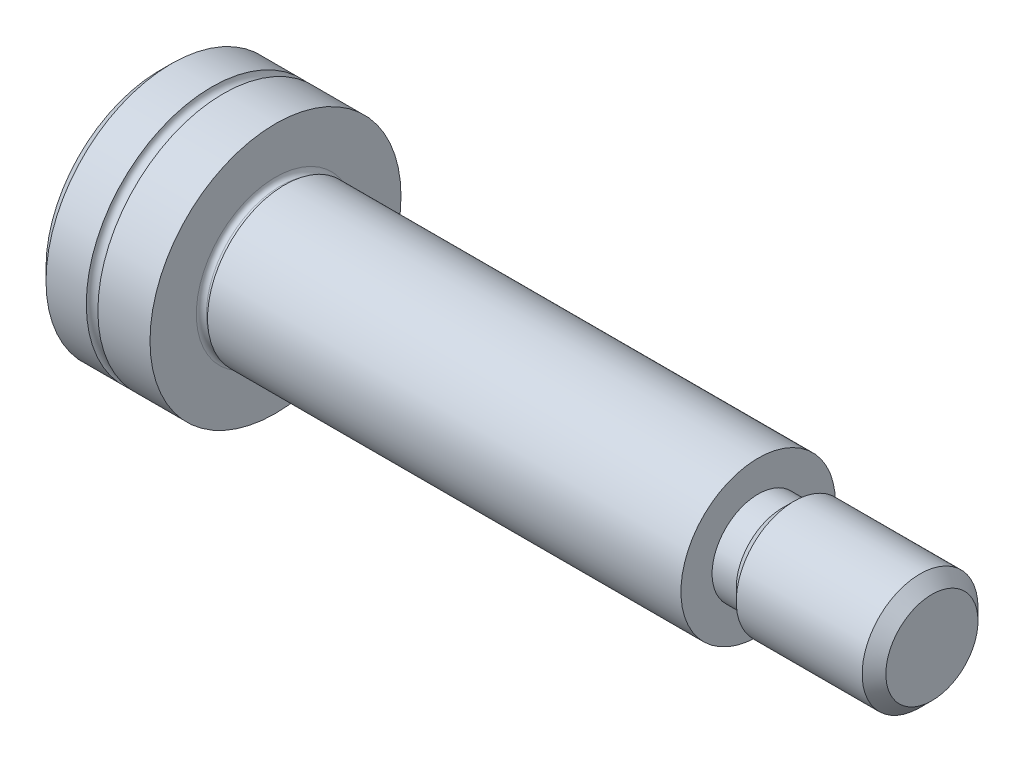
ISO-10303-21;
HEADER;
FILE_DESCRIPTION(('STEP AP214'),'2;1');
FILE_NAME('part.step','',(''),(''),'','','');
FILE_SCHEMA(('AUTOMOTIVE_DESIGN { 1 0 10303 214 1 1 1 1 }'));
ENDSEC;
DATA;
#1=APPLICATION_CONTEXT('core data for automotive mechanical design processes');
#2=APPLICATION_PROTOCOL_DEFINITION('international standard','automotive_design',2000,#1);
#3=PRODUCT_CONTEXT('',#1,'mechanical');
#4=PRODUCT('Part','Part','',(#3));
#5=PRODUCT_RELATED_PRODUCT_CATEGORY('part','',(#4));
#6=PRODUCT_DEFINITION_FORMATION('','',#4);
#7=PRODUCT_DEFINITION_CONTEXT('part definition',#1,'design');
#8=PRODUCT_DEFINITION('design','',#6,#7);
#9=PRODUCT_DEFINITION_SHAPE('','',#8);
#10=(LENGTH_UNIT() NAMED_UNIT(*) SI_UNIT(.MILLI.,.METRE.));
#11=(NAMED_UNIT(*) PLANE_ANGLE_UNIT() SI_UNIT($,.RADIAN.));
#12=(NAMED_UNIT(*) SI_UNIT($,.STERADIAN.) SOLID_ANGLE_UNIT());
#13=UNCERTAINTY_MEASURE_WITH_UNIT(LENGTH_MEASURE(1.E-05),#10,'distance_accuracy_value','');
#14=(GEOMETRIC_REPRESENTATION_CONTEXT(3) GLOBAL_UNCERTAINTY_ASSIGNED_CONTEXT((#13)) GLOBAL_UNIT_ASSIGNED_CONTEXT((#10,
#11,#12)) REPRESENTATION_CONTEXT('',''));
#15=CARTESIAN_POINT('',(0.,0.,0.));
#16=DIRECTION('',(0.,0.,1.));
#17=DIRECTION('',(1.,0.,0.));
#18=AXIS2_PLACEMENT_3D('',#15,#16,#17);
#19=CARTESIAN_POINT('',(0.,0.,0.));
#20=DIRECTION('',(-1.,0.,0.));
#21=DIRECTION('',(0.,0.,1.));
#22=AXIS2_PLACEMENT_3D('',#19,#20,#21);
#23=CYLINDRICAL_SURFACE('',#22,6.5);
#24=CARTESIAN_POINT('',(0.,0.,0.));
#25=DIRECTION('',(-1.,0.,0.));
#26=DIRECTION('',(0.,0.,1.));
#27=AXIS2_PLACEMENT_3D('',#24,#25,#26);
#28=CIRCLE('',#27,6.5);
#29=CARTESIAN_POINT('',(0.,0.,6.5));
#30=VERTEX_POINT('',#29);
#31=EDGE_CURVE('E160',#30,#30,#28,.T.);
#32=ORIENTED_EDGE('',*,*,#31,.T.);
#33=EDGE_LOOP('',(#32));
#34=FACE_BOUND('',#33,.T.);
#35=CARTESIAN_POINT('',(-2.7,0.,0.));
#36=DIRECTION('',(-1.,0.,0.));
#37=DIRECTION('',(0.,0.,1.));
#38=AXIS2_PLACEMENT_3D('',#35,#36,#37);
#39=CIRCLE('',#38,6.5);
#40=CARTESIAN_POINT('',(-2.7,0.,6.5));
#41=VERTEX_POINT('',#40);
#42=EDGE_CURVE('E166',#41,#41,#39,.T.);
#43=ORIENTED_EDGE('',*,*,#42,.F.);
#44=EDGE_LOOP('',(#43));
#45=FACE_BOUND('',#44,.T.);
#46=ADVANCED_FACE('F32',(#34,#45),#23,.T.);
#47=CARTESIAN_POINT('',(-3.,0.,0.));
#48=DIRECTION('',(-1.,0.,0.));
#49=DIRECTION('',(0.,0.,1.));
#50=AXIS2_PLACEMENT_3D('',#47,#48,#49);
#51=TOROIDAL_SURFACE('',#50,6.5,0.299999999999998);
#52=ORIENTED_EDGE('',*,*,#42,.T.);
#53=EDGE_LOOP('',(#52));
#54=FACE_BOUND('',#53,.T.);
#55=CARTESIAN_POINT('',(-3.3,0.,0.));
#56=DIRECTION('',(-1.,0.,0.));
#57=DIRECTION('',(0.,0.,1.));
#58=AXIS2_PLACEMENT_3D('',#55,#56,#57);
#59=CIRCLE('',#58,6.5);
#60=CARTESIAN_POINT('',(-3.3,0.,6.5));
#61=VERTEX_POINT('',#60);
#62=EDGE_CURVE('E163',#61,#61,#59,.T.);
#63=ORIENTED_EDGE('',*,*,#62,.F.);
#64=EDGE_LOOP('',(#63));
#65=FACE_BOUND('',#64,.T.);
#66=ADVANCED_FACE('F196',(#54,#65),#51,.F.);
#67=CARTESIAN_POINT('',(0.,0.,0.));
#68=DIRECTION('',(-1.,0.,0.));
#69=DIRECTION('',(0.,0.,1.));
#70=AXIS2_PLACEMENT_3D('',#67,#68,#69);
#71=CYLINDRICAL_SURFACE('',#70,6.5);
#72=CARTESIAN_POINT('',(-5.38650000003255,0.,0.));
#73=DIRECTION('',(-1.,0.,0.));
#74=DIRECTION('',(0.,0.,1.));
#75=AXIS2_PLACEMENT_3D('',#72,#73,#74);
#76=CIRCLE('',#75,6.5);
#77=CARTESIAN_POINT('',(-5.38650000003255,0.,6.5));
#78=VERTEX_POINT('',#77);
#79=EDGE_CURVE('E172',#78,#78,#76,.F.);
#80=ORIENTED_EDGE('',*,*,#79,.T.);
#81=EDGE_LOOP('',(#80));
#82=FACE_BOUND('',#81,.T.);
#83=ORIENTED_EDGE('',*,*,#62,.T.);
#84=EDGE_LOOP('',(#83));
#85=FACE_BOUND('',#84,.T.);
#86=ADVANCED_FACE('F202',(#82,#85),#71,.T.);
#87=CARTESIAN_POINT('',(-6.,0.,0.));
#88=DIRECTION('',(-1.,0.,0.));
#89=DIRECTION('',(0.,0.,1.));
#90=AXIS2_PLACEMENT_3D('',#87,#88,#89);
#91=PLANE('',#90);
#92=CARTESIAN_POINT('',(-6.,0.,0.));
#93=DIRECTION('',(-1.,0.,0.));
#94=DIRECTION('',(0.,0.,1.));
#95=AXIS2_PLACEMENT_3D('',#92,#93,#94);
#96=CIRCLE('',#95,5.88649999997571);
#97=CARTESIAN_POINT('',(-6.,0.,5.88649999997571));
#98=VERTEX_POINT('',#97);
#99=EDGE_CURVE('E169',#98,#98,#96,.T.);
#100=ORIENTED_EDGE('',*,*,#99,.T.);
#101=EDGE_LOOP('',(#100));
#102=FACE_BOUND('',#101,.T.);
#103=DIRECTION('',(0.,0.500000000000001,0.866025403784438));
#104=VECTOR('',#103,1.);
#105=CARTESIAN_POINT('',(-6.,-2.88675134594813,0.));
#106=LINE('',#105,#104);
#107=CARTESIAN_POINT('',(-6.,-2.88675134594813,0.));
#108=VERTEX_POINT('',#107);
#109=CARTESIAN_POINT('',(-6.,-1.44337567297406,2.5));
#110=VERTEX_POINT('',#109);
#111=EDGE_CURVE('E47',#108,#110,#106,.T.);
#112=ORIENTED_EDGE('',*,*,#111,.F.);
#113=DIRECTION('',(0.,-0.500000000000001,0.866025403784438));
#114=VECTOR('',#113,1.);
#115=CARTESIAN_POINT('',(-6.,-1.44337567297406,-2.5));
#116=LINE('',#115,#114);
#117=CARTESIAN_POINT('',(-6.,-1.44337567297406,-2.5));
#118=VERTEX_POINT('',#117);
#119=EDGE_CURVE('E133',#118,#108,#116,.T.);
#120=ORIENTED_EDGE('',*,*,#119,.F.);
#121=DIRECTION('',(0.,-1.,0.));
#122=VECTOR('',#121,1.);
#123=CARTESIAN_POINT('',(-6.,1.44337567297406,-2.5));
#124=LINE('',#123,#122);
#125=CARTESIAN_POINT('',(-6.,1.44337567297406,-2.5));
#126=VERTEX_POINT('',#125);
#127=EDGE_CURVE('E131',#126,#118,#124,.T.);
#128=ORIENTED_EDGE('',*,*,#127,.F.);
#129=DIRECTION('',(0.,-0.500000000000001,-0.866025403784438));
#130=VECTOR('',#129,1.);
#131=CARTESIAN_POINT('',(-6.,2.88675134594813,0.));
#132=LINE('',#131,#130);
#133=CARTESIAN_POINT('',(-6.,2.88675134594813,0.));
#134=VERTEX_POINT('',#133);
#135=EDGE_CURVE('E97',#134,#126,#132,.T.);
#136=ORIENTED_EDGE('',*,*,#135,.F.);
#137=DIRECTION('',(0.,0.5,-0.866025403784438));
#138=VECTOR('',#137,1.);
#139=CARTESIAN_POINT('',(-6.,1.44337567297406,2.5));
#140=LINE('',#139,#138);
#141=CARTESIAN_POINT('',(-6.,1.44337567297406,2.5));
#142=VERTEX_POINT('',#141);
#143=EDGE_CURVE('E127',#142,#134,#140,.T.);
#144=ORIENTED_EDGE('',*,*,#143,.F.);
#145=DIRECTION('',(0.,1.,0.));
#146=VECTOR('',#145,1.);
#147=CARTESIAN_POINT('',(-6.,-1.44337567297406,2.5));
#148=LINE('',#147,#146);
#149=EDGE_CURVE('E123',#110,#142,#148,.T.);
#150=ORIENTED_EDGE('',*,*,#149,.F.);
#151=EDGE_LOOP('',(#112,#120,#128,#136,#144,#150));
#152=FACE_BOUND('',#151,.T.);
#153=ADVANCED_FACE('F220',(#102,#152),#91,.T.);
#154=CARTESIAN_POINT('',(0.,6.5,0.));
#155=DIRECTION('',(1.,0.,0.));
#156=DIRECTION('',(0.,0.,-1.));
#157=AXIS2_PLACEMENT_3D('',#154,#155,#156);
#158=PLANE('',#157);
#159=CARTESIAN_POINT('',(0.,0.,0.));
#160=DIRECTION('',(1.,0.,0.));
#161=DIRECTION('',(0.,0.,-1.));
#162=AXIS2_PLACEMENT_3D('',#159,#160,#161);
#163=CIRCLE('',#162,4.101);
#164=CARTESIAN_POINT('',(0.,0.,-4.101));
#165=VERTEX_POINT('',#164);
#166=EDGE_CURVE('E11',#165,#165,#163,.F.);
#167=ORIENTED_EDGE('',*,*,#166,.T.);
#168=EDGE_LOOP('',(#167));
#169=FACE_BOUND('',#168,.T.);
#170=ORIENTED_EDGE('',*,*,#31,.F.);
#171=EDGE_LOOP('',(#170));
#172=FACE_BOUND('',#171,.T.);
#173=ADVANCED_FACE('F223',(#169,#172),#158,.T.);
#174=CARTESIAN_POINT('',(0.387623956953576,0.,0.));
#175=DIRECTION('',(-1.,0.,0.));
#176=DIRECTION('',(0.,0.,1.));
#177=AXIS2_PLACEMENT_3D('',#174,#175,#176);
#178=CYLINDRICAL_SURFACE('',#177,3.84);
#179=CARTESIAN_POINT('',(0.261000000000001,0.,0.));
#180=DIRECTION('',(1.,0.,0.));
#181=DIRECTION('',(0.,0.,-1.));
#182=AXIS2_PLACEMENT_3D('',#179,#180,#181);
#183=CIRCLE('',#182,3.84);
#184=CARTESIAN_POINT('',(0.261000000000001,0.,-3.84));
#185=VERTEX_POINT('',#184);
#186=EDGE_CURVE('E40',#185,#185,#183,.T.);
#187=ORIENTED_EDGE('',*,*,#186,.T.);
#188=EDGE_LOOP('',(#187));
#189=FACE_BOUND('',#188,.T.);
#190=CARTESIAN_POINT('',(0.387623956953576,0.,0.));
#191=DIRECTION('',(1.,0.,0.));
#192=DIRECTION('',(0.,0.,-1.));
#193=AXIS2_PLACEMENT_3D('',#190,#191,#192);
#194=CIRCLE('',#193,3.84);
#195=CARTESIAN_POINT('',(0.387623956953576,0.,-3.84));
#196=VERTEX_POINT('',#195);
#197=EDGE_CURVE('E157',#196,#196,#194,.T.);
#198=ORIENTED_EDGE('',*,*,#197,.F.);
#199=EDGE_LOOP('',(#198));
#200=FACE_BOUND('',#199,.T.);
#201=ADVANCED_FACE('F183',(#189,#200),#178,.T.);
#202=CARTESIAN_POINT('',(0.387623956953576,0.,0.));
#203=DIRECTION('',(1.,0.,0.));
#204=DIRECTION('',(0.,0.,-1.));
#205=AXIS2_PLACEMENT_3D('',#202,#203,#204);
#206=CONICAL_SURFACE('',#205,3.83999999996831,1.04719755126488);
#207=CARTESIAN_POINT('',(0.480000000000001,0.,0.));
#208=DIRECTION('',(1.,0.,0.));
#209=DIRECTION('',(0.,0.,-1.));
#210=AXIS2_PLACEMENT_3D('',#207,#208,#209);
#211=CIRCLE('',#210,3.99999999995212);
#212=CARTESIAN_POINT('',(0.480000000000001,0.,-3.99999999995212));
#213=VERTEX_POINT('',#212);
#214=EDGE_CURVE('E154',#213,#213,#211,.T.);
#215=ORIENTED_EDGE('',*,*,#214,.F.);
#216=EDGE_LOOP('',(#215));
#217=FACE_BOUND('',#216,.T.);
#218=ORIENTED_EDGE('',*,*,#197,.T.);
#219=EDGE_LOOP('',(#218));
#220=FACE_BOUND('',#219,.T.);
#221=ADVANCED_FACE('F281',(#217,#220),#206,.T.);
#222=CARTESIAN_POINT('',(25.,0.,0.));
#223=DIRECTION('',(-1.,0.,0.));
#224=DIRECTION('',(0.,0.,1.));
#225=AXIS2_PLACEMENT_3D('',#222,#223,#224);
#226=CYLINDRICAL_SURFACE('',#225,4.);
#227=CARTESIAN_POINT('',(25.,0.,0.));
#228=DIRECTION('',(1.,0.,0.));
#229=DIRECTION('',(0.,0.,-1.));
#230=AXIS2_PLACEMENT_3D('',#227,#228,#229);
#231=CIRCLE('',#230,4.);
#232=CARTESIAN_POINT('',(25.,0.,-4.));
#233=VERTEX_POINT('',#232);
#234=EDGE_CURVE('E149',#233,#233,#231,.T.);
#235=ORIENTED_EDGE('',*,*,#234,.F.);
#236=EDGE_LOOP('',(#235));
#237=FACE_BOUND('',#236,.T.);
#238=ORIENTED_EDGE('',*,*,#214,.T.);
#239=EDGE_LOOP('',(#238));
#240=FACE_BOUND('',#239,.T.);
#241=ADVANCED_FACE('F277',(#237,#240),#226,.T.);
#242=CARTESIAN_POINT('',(25.,0.,0.));
#243=DIRECTION('',(1.,0.,0.));
#244=DIRECTION('',(0.,0.,-1.));
#245=AXIS2_PLACEMENT_3D('',#242,#243,#244);
#246=PLANE('',#245);
#247=CARTESIAN_POINT('',(25.,0.,0.));
#248=DIRECTION('',(1.,0.,0.));
#249=DIRECTION('',(0.,0.,-1.));
#250=AXIS2_PLACEMENT_3D('',#247,#248,#249);
#251=CIRCLE('',#250,2.3865);
#252=CARTESIAN_POINT('',(25.,0.,-2.3865));
#253=VERTEX_POINT('',#252);
#254=EDGE_CURVE('E145',#253,#253,#251,.T.);
#255=ORIENTED_EDGE('',*,*,#254,.F.);
#256=EDGE_LOOP('',(#255));
#257=FACE_BOUND('',#256,.T.);
#258=ORIENTED_EDGE('',*,*,#234,.T.);
#259=EDGE_LOOP('',(#258));
#260=FACE_BOUND('',#259,.T.);
#261=ADVANCED_FACE('F273',(#257,#260),#246,.T.);
#262=CARTESIAN_POINT('',(26.25,0.,0.));
#263=DIRECTION('',(-1.,0.,0.));
#264=DIRECTION('',(0.,0.,1.));
#265=AXIS2_PLACEMENT_3D('',#262,#263,#264);
#266=CYLINDRICAL_SURFACE('',#265,2.3865);
#267=CARTESIAN_POINT('',(26.25,0.,0.));
#268=DIRECTION('',(1.,0.,0.));
#269=DIRECTION('',(0.,0.,-1.));
#270=AXIS2_PLACEMENT_3D('',#267,#268,#269);
#271=CIRCLE('',#270,2.3865);
#272=CARTESIAN_POINT('',(26.25,0.,-2.3865));
#273=VERTEX_POINT('',#272);
#274=EDGE_CURVE('E146',#273,#273,#271,.T.);
#275=ORIENTED_EDGE('',*,*,#274,.F.);
#276=EDGE_LOOP('',(#275));
#277=FACE_BOUND('',#276,.T.);
#278=ORIENTED_EDGE('',*,*,#254,.T.);
#279=EDGE_LOOP('',(#278));
#280=FACE_BOUND('',#279,.T.);
#281=ADVANCED_FACE('F269',(#277,#280),#266,.T.);
#282=CARTESIAN_POINT('',(26.25,0.,0.));
#283=DIRECTION('',(1.,0.,0.));
#284=DIRECTION('',(0.,0.,-1.));
#285=AXIS2_PLACEMENT_3D('',#282,#283,#284);
#286=CONICAL_SURFACE('',#285,2.38650000005236,0.785398163397452);
#287=CARTESIAN_POINT('',(26.8634999999335,0.,0.));
#288=DIRECTION('',(1.,0.,0.));
#289=DIRECTION('',(0.,0.,-1.));
#290=AXIS2_PLACEMENT_3D('',#287,#288,#289);
#291=CIRCLE('',#290,2.99999999998591);
#292=CARTESIAN_POINT('',(26.8634999999335,0.,-2.99999999998591));
#293=VERTEX_POINT('',#292);
#294=EDGE_CURVE('E137',#293,#293,#291,.T.);
#295=ORIENTED_EDGE('',*,*,#294,.F.);
#296=EDGE_LOOP('',(#295));
#297=FACE_BOUND('',#296,.T.);
#298=ORIENTED_EDGE('',*,*,#274,.T.);
#299=EDGE_LOOP('',(#298));
#300=FACE_BOUND('',#299,.T.);
#301=ADVANCED_FACE('F265',(#297,#300),#286,.T.);
#302=CARTESIAN_POINT('',(34.,0.,0.));
#303=DIRECTION('',(-1.,0.,0.));
#304=DIRECTION('',(0.,0.,1.));
#305=AXIS2_PLACEMENT_3D('',#302,#303,#304);
#306=CYLINDRICAL_SURFACE('',#305,3.);
#307=CARTESIAN_POINT('',(33.3865000000326,0.,0.));
#308=DIRECTION('',(1.,0.,0.));
#309=DIRECTION('',(0.,0.,-1.));
#310=AXIS2_PLACEMENT_3D('',#307,#308,#309);
#311=CIRCLE('',#310,3.);
#312=CARTESIAN_POINT('',(33.3865000000326,0.,-3.));
#313=VERTEX_POINT('',#312);
#314=EDGE_CURVE('E178',#313,#313,#311,.F.);
#315=ORIENTED_EDGE('',*,*,#314,.T.);
#316=EDGE_LOOP('',(#315));
#317=FACE_BOUND('',#316,.T.);
#318=ORIENTED_EDGE('',*,*,#294,.T.);
#319=EDGE_LOOP('',(#318));
#320=FACE_BOUND('',#319,.T.);
#321=ADVANCED_FACE('F261',(#317,#320),#306,.T.);
#322=CARTESIAN_POINT('',(34.,0.,0.));
#323=DIRECTION('',(1.,0.,0.));
#324=DIRECTION('',(0.,0.,-1.));
#325=AXIS2_PLACEMENT_3D('',#322,#323,#324);
#326=PLANE('',#325);
#327=CARTESIAN_POINT('',(34.,0.,0.));
#328=DIRECTION('',(1.,0.,0.));
#329=DIRECTION('',(0.,0.,-1.));
#330=AXIS2_PLACEMENT_3D('',#327,#328,#329);
#331=CIRCLE('',#330,2.38649999997573);
#332=CARTESIAN_POINT('',(34.,0.,-2.38649999997573));
#333=VERTEX_POINT('',#332);
#334=EDGE_CURVE('E175',#333,#333,#331,.T.);
#335=ORIENTED_EDGE('',*,*,#334,.T.);
#336=EDGE_LOOP('',(#335));
#337=FACE_BOUND('',#336,.T.);
#338=ADVANCED_FACE('F258',(#337),#326,.T.);
#339=CARTESIAN_POINT('',(-3.,-2.88675134594813,0.));
#340=DIRECTION('',(0.,-0.866025403784438,0.500000000000001));
#341=DIRECTION('',(0.,-0.500000000000001,-0.866025403784438));
#342=AXIS2_PLACEMENT_3D('',#339,#340,#341);
#343=PLANE('',#342);
#344=ORIENTED_EDGE('',*,*,#111,.T.);
#345=DIRECTION('',(-1.,0.,0.));
#346=VECTOR('',#345,1.);
#347=CARTESIAN_POINT('',(-3.,-1.44337567297406,2.5));
#348=LINE('',#347,#346);
#349=CARTESIAN_POINT('',(-3.,-1.44337567297406,2.5));
#350=VERTEX_POINT('',#349);
#351=EDGE_CURVE('E78',#350,#110,#348,.T.);
#352=ORIENTED_EDGE('',*,*,#351,.F.);
#353=DIRECTION('',(0.,0.500000000000001,0.866025403784438));
#354=VECTOR('',#353,1.);
#355=CARTESIAN_POINT('',(-3.,-2.88675134594813,0.));
#356=LINE('',#355,#354);
#357=CARTESIAN_POINT('',(-3.,-2.88675134594813,0.));
#358=VERTEX_POINT('',#357);
#359=EDGE_CURVE('E135',#358,#350,#356,.T.);
#360=ORIENTED_EDGE('',*,*,#359,.F.);
#361=DIRECTION('',(-1.,0.,0.));
#362=VECTOR('',#361,1.);
#363=CARTESIAN_POINT('',(-3.,-2.88675134594813,0.));
#364=LINE('',#363,#362);
#365=EDGE_CURVE('E55',#358,#108,#364,.T.);
#366=ORIENTED_EDGE('',*,*,#365,.T.);
#367=EDGE_LOOP('',(#344,#352,#360,#366));
#368=FACE_BOUND('',#367,.T.);
#369=ADVANCED_FACE('F248',(#368),#343,.F.);
#370=CARTESIAN_POINT('',(-3.,-1.44337567297406,-2.5));
#371=DIRECTION('',(0.,-0.866025403784438,-0.500000000000001));
#372=DIRECTION('',(0.,0.500000000000001,-0.866025403784438));
#373=AXIS2_PLACEMENT_3D('',#370,#371,#372);
#374=PLANE('',#373);
#375=ORIENTED_EDGE('',*,*,#119,.T.);
#376=ORIENTED_EDGE('',*,*,#365,.F.);
#377=DIRECTION('',(0.,-0.500000000000001,0.866025403784438));
#378=VECTOR('',#377,1.);
#379=CARTESIAN_POINT('',(-3.,-1.44337567297406,-2.5));
#380=LINE('',#379,#378);
#381=CARTESIAN_POINT('',(-3.,-1.44337567297406,-2.5));
#382=VERTEX_POINT('',#381);
#383=EDGE_CURVE('E109',#382,#358,#380,.T.);
#384=ORIENTED_EDGE('',*,*,#383,.F.);
#385=DIRECTION('',(-1.,0.,0.));
#386=VECTOR('',#385,1.);
#387=CARTESIAN_POINT('',(-3.,-1.44337567297406,-2.5));
#388=LINE('',#387,#386);
#389=EDGE_CURVE('E101',#382,#118,#388,.T.);
#390=ORIENTED_EDGE('',*,*,#389,.T.);
#391=EDGE_LOOP('',(#375,#376,#384,#390));
#392=FACE_BOUND('',#391,.T.);
#393=ADVANCED_FACE('F245',(#392),#374,.F.);
#394=CARTESIAN_POINT('',(-3.,1.44337567297406,-2.5));
#395=DIRECTION('',(0.,0.,-1.));
#396=DIRECTION('',(0.,1.,0.));
#397=AXIS2_PLACEMENT_3D('',#394,#395,#396);
#398=PLANE('',#397);
#399=ORIENTED_EDGE('',*,*,#127,.T.);
#400=ORIENTED_EDGE('',*,*,#389,.F.);
#401=DIRECTION('',(0.,-1.,0.));
#402=VECTOR('',#401,1.);
#403=CARTESIAN_POINT('',(-3.,1.44337567297406,-2.5));
#404=LINE('',#403,#402);
#405=CARTESIAN_POINT('',(-3.,1.44337567297406,-2.5));
#406=VERTEX_POINT('',#405);
#407=EDGE_CURVE('E105',#406,#382,#404,.T.);
#408=ORIENTED_EDGE('',*,*,#407,.F.);
#409=DIRECTION('',(-1.,0.,0.));
#410=VECTOR('',#409,1.);
#411=CARTESIAN_POINT('',(-3.,1.44337567297406,-2.5));
#412=LINE('',#411,#410);
#413=EDGE_CURVE('E90',#406,#126,#412,.T.);
#414=ORIENTED_EDGE('',*,*,#413,.T.);
#415=EDGE_LOOP('',(#399,#400,#408,#414));
#416=FACE_BOUND('',#415,.T.);
#417=ADVANCED_FACE('F106',(#416),#398,.F.);
#418=CARTESIAN_POINT('',(-3.,2.88675134594813,0.));
#419=DIRECTION('',(0.,0.866025403784438,-0.500000000000001));
#420=DIRECTION('',(0.,0.500000000000001,0.866025403784438));
#421=AXIS2_PLACEMENT_3D('',#418,#419,#420);
#422=PLANE('',#421);
#423=ORIENTED_EDGE('',*,*,#135,.T.);
#424=ORIENTED_EDGE('',*,*,#413,.F.);
#425=DIRECTION('',(0.,-0.500000000000001,-0.866025403784438));
#426=VECTOR('',#425,1.);
#427=CARTESIAN_POINT('',(-3.,2.88675134594813,0.));
#428=LINE('',#427,#426);
#429=CARTESIAN_POINT('',(-3.,2.88675134594813,0.));
#430=VERTEX_POINT('',#429);
#431=EDGE_CURVE('E94',#430,#406,#428,.T.);
#432=ORIENTED_EDGE('',*,*,#431,.F.);
#433=DIRECTION('',(-1.,0.,0.));
#434=VECTOR('',#433,1.);
#435=CARTESIAN_POINT('',(-3.,2.88675134594813,0.));
#436=LINE('',#435,#434);
#437=EDGE_CURVE('E102',#430,#134,#436,.T.);
#438=ORIENTED_EDGE('',*,*,#437,.T.);
#439=EDGE_LOOP('',(#423,#424,#432,#438));
#440=FACE_BOUND('',#439,.T.);
#441=ADVANCED_FACE('F92',(#440),#422,.F.);
#442=CARTESIAN_POINT('',(-3.,1.44337567297406,2.5));
#443=DIRECTION('',(0.,0.866025403784438,0.500000000000001));
#444=DIRECTION('',(0.,-0.500000000000001,0.866025403784438));
#445=AXIS2_PLACEMENT_3D('',#442,#443,#444);
#446=PLANE('',#445);
#447=ORIENTED_EDGE('',*,*,#143,.T.);
#448=ORIENTED_EDGE('',*,*,#437,.F.);
#449=DIRECTION('',(0.,0.5,-0.866025403784438));
#450=VECTOR('',#449,1.);
#451=CARTESIAN_POINT('',(-3.,1.44337567297406,2.5));
#452=LINE('',#451,#450);
#453=CARTESIAN_POINT('',(-3.,1.44337567297406,2.5));
#454=VERTEX_POINT('',#453);
#455=EDGE_CURVE('E115',#454,#430,#452,.T.);
#456=ORIENTED_EDGE('',*,*,#455,.F.);
#457=DIRECTION('',(-1.,0.,0.));
#458=VECTOR('',#457,1.);
#459=CARTESIAN_POINT('',(-3.,1.44337567297406,2.5));
#460=LINE('',#459,#458);
#461=EDGE_CURVE('E140',#454,#142,#460,.T.);
#462=ORIENTED_EDGE('',*,*,#461,.T.);
#463=EDGE_LOOP('',(#447,#448,#456,#462));
#464=FACE_BOUND('',#463,.T.);
#465=ADVANCED_FACE('F242',(#464),#446,.F.);
#466=CARTESIAN_POINT('',(-3.,-1.44337567297406,2.5));
#467=DIRECTION('',(0.,0.,1.));
#468=DIRECTION('',(0.,-1.,0.));
#469=AXIS2_PLACEMENT_3D('',#466,#467,#468);
#470=PLANE('',#469);
#471=ORIENTED_EDGE('',*,*,#149,.T.);
#472=ORIENTED_EDGE('',*,*,#461,.F.);
#473=DIRECTION('',(0.,1.,0.));
#474=VECTOR('',#473,1.);
#475=CARTESIAN_POINT('',(-3.,-1.44337567297406,2.5));
#476=LINE('',#475,#474);
#477=EDGE_CURVE('E117',#350,#454,#476,.T.);
#478=ORIENTED_EDGE('',*,*,#477,.F.);
#479=ORIENTED_EDGE('',*,*,#351,.T.);
#480=EDGE_LOOP('',(#471,#472,#478,#479));
#481=FACE_BOUND('',#480,.T.);
#482=ADVANCED_FACE('F229',(#481),#470,.F.);
#483=CARTESIAN_POINT('',(-3.,0.,0.));
#484=DIRECTION('',(-1.,0.,0.));
#485=DIRECTION('',(0.,0.,1.));
#486=AXIS2_PLACEMENT_3D('',#483,#484,#485);
#487=PLANE('',#486);
#488=CARTESIAN_POINT('',(-3.00000000000314,0.,0.));
#489=DIRECTION('',(1.,0.,0.));
#490=DIRECTION('',(0.,1.,0.));
#491=AXIS2_PLACEMENT_3D('',#488,#489,#490);
#492=CIRCLE('',#491,2.39999999999816);
#493=CARTESIAN_POINT('',(-3.00000000000314,2.39999999999816,0.));
#494=VERTEX_POINT('',#493);
#495=EDGE_CURVE('E124',#494,#494,#492,.T.);
#496=ORIENTED_EDGE('',*,*,#495,.T.);
#497=EDGE_LOOP('',(#496));
#498=FACE_BOUND('',#497,.T.);
#499=ORIENTED_EDGE('',*,*,#359,.T.);
#500=ORIENTED_EDGE('',*,*,#477,.T.);
#501=ORIENTED_EDGE('',*,*,#455,.T.);
#502=ORIENTED_EDGE('',*,*,#431,.T.);
#503=ORIENTED_EDGE('',*,*,#407,.T.);
#504=ORIENTED_EDGE('',*,*,#383,.T.);
#505=EDGE_LOOP('',(#499,#500,#501,#502,#503,#504));
#506=FACE_BOUND('',#505,.T.);
#507=ADVANCED_FACE('F112',(#498,#506),#487,.T.);
#508=CARTESIAN_POINT('',(-1.6143593539491,0.,0.));
#509=DIRECTION('',(-1.,0.,0.));
#510=DIRECTION('',(0.,-1.,0.));
#511=AXIS2_PLACEMENT_3D('',#508,#509,#510);
#512=CONICAL_SURFACE('',#511,0.,1.0471975511966);
#513=ORIENTED_EDGE('',*,*,#495,.F.);
#514=EDGE_LOOP('',(#513));
#515=FACE_BOUND('',#514,.T.);
#516=CARTESIAN_POINT('',(-1.6143593539491,0.,0.));
#517=VERTEX_POINT('',#516);
#518=VERTEX_LOOP('',#517);
#519=FACE_BOUND('',#518,.T.);
#520=ADVANCED_FACE('F209',(#515,#519),#512,.F.);
#521=CARTESIAN_POINT('',(-6.,0.,0.));
#522=DIRECTION('',(1.,0.,0.));
#523=DIRECTION('',(0.,0.,-1.));
#524=AXIS2_PLACEMENT_3D('',#521,#522,#523);
#525=CONICAL_SURFACE('',#524,5.88649999997571,0.785398163443774);
#526=ORIENTED_EDGE('',*,*,#79,.F.);
#527=EDGE_LOOP('',(#526));
#528=FACE_BOUND('',#527,.T.);
#529=ORIENTED_EDGE('',*,*,#99,.F.);
#530=EDGE_LOOP('',(#529));
#531=FACE_BOUND('',#530,.T.);
#532=ADVANCED_FACE('F192',(#528,#531),#525,.T.);
#533=CARTESIAN_POINT('',(34.,0.,0.));
#534=DIRECTION('',(-1.,0.,0.));
#535=DIRECTION('',(0.,0.,1.));
#536=AXIS2_PLACEMENT_3D('',#533,#534,#535);
#537=CONICAL_SURFACE('',#536,2.38649999997573,0.785398163443773);
#538=ORIENTED_EDGE('',*,*,#314,.F.);
#539=EDGE_LOOP('',(#538));
#540=FACE_BOUND('',#539,.T.);
#541=ORIENTED_EDGE('',*,*,#334,.F.);
#542=EDGE_LOOP('',(#541));
#543=FACE_BOUND('',#542,.T.);
#544=ADVANCED_FACE('F187',(#540,#543),#537,.T.);
#545=CARTESIAN_POINT('',(0.261000000000001,0.,0.));
#546=DIRECTION('',(1.,0.,0.));
#547=DIRECTION('',(0.,0.,-1.));
#548=AXIS2_PLACEMENT_3D('',#545,#546,#547);
#549=TOROIDAL_SURFACE('',#548,4.101,0.261000000000001);
#550=ORIENTED_EDGE('',*,*,#166,.F.);
#551=EDGE_LOOP('',(#550));
#552=FACE_BOUND('',#551,.T.);
#553=ORIENTED_EDGE('',*,*,#186,.F.);
#554=EDGE_LOOP('',(#553));
#555=FACE_BOUND('',#554,.T.);
#556=ADVANCED_FACE('F34',(#552,#555),#549,.F.);
#557=CLOSED_SHELL('',(#46,#66,#86,#153,#173,#201,#221,#241,#261,#281,#301,#321,#338,#369,#393,
#417,#441,#465,#482,#507,#520,#532,#544,#556));
#558=MANIFOLD_SOLID_BREP('B2',#557);
#559=ADVANCED_BREP_SHAPE_REPRESENTATION('',(#18,#558),#14);
#560=SHAPE_DEFINITION_REPRESENTATION(#9,#559);
ENDSEC;
END-ISO-10303-21;
